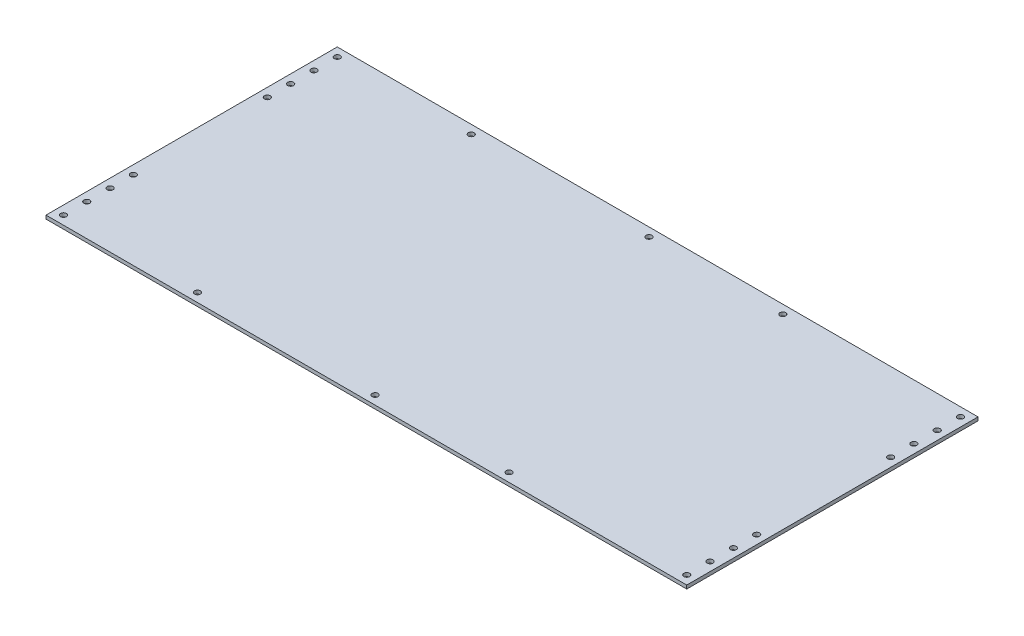
ISO-10303-21;
HEADER;
FILE_DESCRIPTION(('STEP AP214'),'2;1');
FILE_NAME('part.step','',(''),(''),'','','');
FILE_SCHEMA(('AUTOMOTIVE_DESIGN { 1 0 10303 214 1 1 1 1 }'));
ENDSEC;
DATA;
#1=APPLICATION_CONTEXT('core data for automotive mechanical design processes');
#2=APPLICATION_PROTOCOL_DEFINITION('international standard','automotive_design',2000,#1);
#3=PRODUCT_CONTEXT('',#1,'mechanical');
#4=PRODUCT('Part','Part','',(#3));
#5=PRODUCT_RELATED_PRODUCT_CATEGORY('part','',(#4));
#6=PRODUCT_DEFINITION_FORMATION('','',#4);
#7=PRODUCT_DEFINITION_CONTEXT('part definition',#1,'design');
#8=PRODUCT_DEFINITION('design','',#6,#7);
#9=PRODUCT_DEFINITION_SHAPE('','',#8);
#10=(LENGTH_UNIT() NAMED_UNIT(*) SI_UNIT(.MILLI.,.METRE.));
#11=(NAMED_UNIT(*) PLANE_ANGLE_UNIT() SI_UNIT($,.RADIAN.));
#12=(NAMED_UNIT(*) SI_UNIT($,.STERADIAN.) SOLID_ANGLE_UNIT());
#13=UNCERTAINTY_MEASURE_WITH_UNIT(LENGTH_MEASURE(1.E-05),#10,'distance_accuracy_value','');
#14=(GEOMETRIC_REPRESENTATION_CONTEXT(3) GLOBAL_UNCERTAINTY_ASSIGNED_CONTEXT((#13)) GLOBAL_UNIT_ASSIGNED_CONTEXT((#10,
#11,#12)) REPRESENTATION_CONTEXT('',''));
#15=CARTESIAN_POINT('',(0.,0.,0.));
#16=DIRECTION('',(0.,0.,1.));
#17=DIRECTION('',(1.,0.,0.));
#18=AXIS2_PLACEMENT_3D('',#15,#16,#17);
#19=CARTESIAN_POINT('',(-1100.,-12.,499.999999999999));
#20=DIRECTION('',(-1.,0.,0.));
#21=DIRECTION('',(0.,0.,1.));
#22=AXIS2_PLACEMENT_3D('',#19,#20,#21);
#23=PLANE('',#22);
#24=DIRECTION('',(0.,0.,1.));
#25=VECTOR('',#24,1.);
#26=CARTESIAN_POINT('',(-1100.,0.,499.999999999999));
#27=LINE('',#26,#25);
#28=CARTESIAN_POINT('',(-1100.,0.,-499.999999999999));
#29=VERTEX_POINT('',#28);
#30=CARTESIAN_POINT('',(-1100.,0.,499.999999999999));
#31=VERTEX_POINT('',#30);
#32=EDGE_CURVE('E102',#29,#31,#27,.T.);
#33=ORIENTED_EDGE('',*,*,#32,.F.);
#34=DIRECTION('',(0.,1.,0.));
#35=VECTOR('',#34,1.);
#36=CARTESIAN_POINT('',(-1100.,-12.,-499.999999999999));
#37=LINE('',#36,#35);
#38=CARTESIAN_POINT('',(-1100.,-12.,-499.999999999999));
#39=VERTEX_POINT('',#38);
#40=EDGE_CURVE('E11',#39,#29,#37,.T.);
#41=ORIENTED_EDGE('',*,*,#40,.F.);
#42=DIRECTION('',(0.,0.,1.));
#43=VECTOR('',#42,1.);
#44=CARTESIAN_POINT('',(-1100.,-12.,499.999999999999));
#45=LINE('',#44,#43);
#46=CARTESIAN_POINT('',(-1100.,-12.,499.999999999999));
#47=VERTEX_POINT('',#46);
#48=EDGE_CURVE('E100',#39,#47,#45,.T.);
#49=ORIENTED_EDGE('',*,*,#48,.T.);
#50=DIRECTION('',(0.,1.,0.));
#51=VECTOR('',#50,1.);
#52=CARTESIAN_POINT('',(-1100.,-12.,499.999999999999));
#53=LINE('',#52,#51);
#54=EDGE_CURVE('E45',#47,#31,#53,.T.);
#55=ORIENTED_EDGE('',*,*,#54,.T.);
#56=EDGE_LOOP('',(#33,#41,#49,#55));
#57=FACE_BOUND('',#56,.T.);
#58=ADVANCED_FACE('F39',(#57),#23,.T.);
#59=CARTESIAN_POINT('',(-1100.,-12.,-499.999999999999));
#60=DIRECTION('',(0.,0.,-1.));
#61=DIRECTION('',(-1.,0.,0.));
#62=AXIS2_PLACEMENT_3D('',#59,#60,#61);
#63=PLANE('',#62);
#64=DIRECTION('',(-1.,0.,0.));
#65=VECTOR('',#64,1.);
#66=CARTESIAN_POINT('',(-1100.,0.,-499.999999999999));
#67=LINE('',#66,#65);
#68=CARTESIAN_POINT('',(1100.,0.,-499.999999999999));
#69=VERTEX_POINT('',#68);
#70=EDGE_CURVE('E97',#69,#29,#67,.T.);
#71=ORIENTED_EDGE('',*,*,#70,.F.);
#72=DIRECTION('',(0.,1.,0.));
#73=VECTOR('',#72,1.);
#74=CARTESIAN_POINT('',(1100.,-12.,-499.999999999999));
#75=LINE('',#74,#73);
#76=CARTESIAN_POINT('',(1100.,-12.,-499.999999999999));
#77=VERTEX_POINT('',#76);
#78=EDGE_CURVE('E48',#77,#69,#75,.T.);
#79=ORIENTED_EDGE('',*,*,#78,.F.);
#80=DIRECTION('',(-1.,0.,0.));
#81=VECTOR('',#80,1.);
#82=CARTESIAN_POINT('',(-1100.,-12.,-499.999999999999));
#83=LINE('',#82,#81);
#84=EDGE_CURVE('E94',#77,#39,#83,.T.);
#85=ORIENTED_EDGE('',*,*,#84,.T.);
#86=ORIENTED_EDGE('',*,*,#40,.T.);
#87=EDGE_LOOP('',(#71,#79,#85,#86));
#88=FACE_BOUND('',#87,.T.);
#89=ADVANCED_FACE('F113',(#88),#63,.T.);
#90=CARTESIAN_POINT('',(1100.,-12.,500.000000000001));
#91=DIRECTION('',(1.,0.,0.));
#92=DIRECTION('',(0.,0.,-1.));
#93=AXIS2_PLACEMENT_3D('',#90,#91,#92);
#94=PLANE('',#93);
#95=DIRECTION('',(0.,0.,-1.));
#96=VECTOR('',#95,1.);
#97=CARTESIAN_POINT('',(1100.,0.,500.000000000001));
#98=LINE('',#97,#96);
#99=CARTESIAN_POINT('',(1100.,0.,500.000000000001));
#100=VERTEX_POINT('',#99);
#101=EDGE_CURVE('E90',#100,#69,#98,.T.);
#102=ORIENTED_EDGE('',*,*,#101,.F.);
#103=DIRECTION('',(0.,1.,0.));
#104=VECTOR('',#103,1.);
#105=CARTESIAN_POINT('',(1100.,-12.,500.000000000001));
#106=LINE('',#105,#104);
#107=CARTESIAN_POINT('',(1100.,-12.,500.000000000001));
#108=VERTEX_POINT('',#107);
#109=EDGE_CURVE('E82',#108,#100,#106,.T.);
#110=ORIENTED_EDGE('',*,*,#109,.F.);
#111=DIRECTION('',(0.,0.,-1.));
#112=VECTOR('',#111,1.);
#113=CARTESIAN_POINT('',(1100.,-12.,500.000000000001));
#114=LINE('',#113,#112);
#115=EDGE_CURVE('E87',#108,#77,#114,.T.);
#116=ORIENTED_EDGE('',*,*,#115,.T.);
#117=ORIENTED_EDGE('',*,*,#78,.T.);
#118=EDGE_LOOP('',(#102,#110,#116,#117));
#119=FACE_BOUND('',#118,.T.);
#120=ADVANCED_FACE('F88',(#119),#94,.T.);
#121=CARTESIAN_POINT('',(-1100.,-12.,499.999999999999));
#122=DIRECTION('',(0.,0.,1.));
#123=DIRECTION('',(1.,0.,0.));
#124=AXIS2_PLACEMENT_3D('',#121,#122,#123);
#125=PLANE('',#124);
#126=DIRECTION('',(1.,0.,0.));
#127=VECTOR('',#126,1.);
#128=CARTESIAN_POINT('',(-1100.,0.,499.999999999999));
#129=LINE('',#128,#127);
#130=EDGE_CURVE('E110',#31,#100,#129,.T.);
#131=ORIENTED_EDGE('',*,*,#130,.F.);
#132=ORIENTED_EDGE('',*,*,#54,.F.);
#133=DIRECTION('',(1.,0.,0.));
#134=VECTOR('',#133,1.);
#135=CARTESIAN_POINT('',(-1100.,-12.,499.999999999999));
#136=LINE('',#135,#134);
#137=EDGE_CURVE('E91',#47,#108,#136,.T.);
#138=ORIENTED_EDGE('',*,*,#137,.T.);
#139=ORIENTED_EDGE('',*,*,#109,.T.);
#140=EDGE_LOOP('',(#131,#132,#138,#139));
#141=FACE_BOUND('',#140,.T.);
#142=ADVANCED_FACE('F96',(#141),#125,.T.);
#143=CARTESIAN_POINT('',(0.,-12.,0.));
#144=DIRECTION('',(0.,-1.,0.));
#145=DIRECTION('',(0.,0.,-1.));
#146=AXIS2_PLACEMENT_3D('',#143,#144,#145);
#147=PLANE('',#146);
#148=CARTESIAN_POINT('',(-1070.,-12.,230.000000000003));
#149=DIRECTION('',(0.,1.,0.));
#150=DIRECTION('',(0.,0.,-1.));
#151=AXIS2_PLACEMENT_3D('',#148,#149,#150);
#152=CIRCLE('',#151,10.0000000000001);
#153=CARTESIAN_POINT('',(-1070.,-12.,220.000000000003));
#154=VERTEX_POINT('',#153);
#155=EDGE_CURVE('E229',#154,#154,#152,.T.);
#156=ORIENTED_EDGE('',*,*,#155,.T.);
#157=EDGE_LOOP('',(#156));
#158=FACE_BOUND('',#157,.T.);
#159=CARTESIAN_POINT('',(-1070.,-12.,310.000000000002));
#160=DIRECTION('',(0.,1.,0.));
#161=DIRECTION('',(0.,0.,-1.));
#162=AXIS2_PLACEMENT_3D('',#159,#160,#161);
#163=CIRCLE('',#162,9.99999999999988);
#164=CARTESIAN_POINT('',(-1070.,-12.,300.000000000002));
#165=VERTEX_POINT('',#164);
#166=EDGE_CURVE('E237',#165,#165,#163,.T.);
#167=ORIENTED_EDGE('',*,*,#166,.T.);
#168=EDGE_LOOP('',(#167));
#169=FACE_BOUND('',#168,.T.);
#170=CARTESIAN_POINT('',(-1070.,-12.,390.000000000001));
#171=DIRECTION('',(0.,1.,0.));
#172=DIRECTION('',(0.,0.,-1.));
#173=AXIS2_PLACEMENT_3D('',#170,#171,#172);
#174=CIRCLE('',#173,9.99999999999797);
#175=CARTESIAN_POINT('',(-1070.,-12.,380.000000000003));
#176=VERTEX_POINT('',#175);
#177=EDGE_CURVE('E245',#176,#176,#174,.T.);
#178=ORIENTED_EDGE('',*,*,#177,.T.);
#179=EDGE_LOOP('',(#178));
#180=FACE_BOUND('',#179,.T.);
#181=CARTESIAN_POINT('',(-1070.,-12.,470.));
#182=DIRECTION('',(0.,1.,0.));
#183=DIRECTION('',(0.,0.,-1.));
#184=AXIS2_PLACEMENT_3D('',#181,#182,#183);
#185=CIRCLE('',#184,10.0000000000001);
#186=CARTESIAN_POINT('',(-1070.,-12.,460.));
#187=VERTEX_POINT('',#186);
#188=EDGE_CURVE('E248',#187,#187,#185,.T.);
#189=ORIENTED_EDGE('',*,*,#188,.T.);
#190=EDGE_LOOP('',(#189));
#191=FACE_BOUND('',#190,.T.);
#192=CARTESIAN_POINT('',(-609.999999999998,-12.,469.999999999999));
#193=DIRECTION('',(0.,1.,0.));
#194=DIRECTION('',(0.,0.,-1.));
#195=AXIS2_PLACEMENT_3D('',#192,#193,#194);
#196=CIRCLE('',#195,9.99999999999998);
#197=CARTESIAN_POINT('',(-609.999999999998,-12.,459.999999999999));
#198=VERTEX_POINT('',#197);
#199=EDGE_CURVE('E255',#198,#198,#196,.T.);
#200=ORIENTED_EDGE('',*,*,#199,.T.);
#201=EDGE_LOOP('',(#200));
#202=FACE_BOUND('',#201,.T.);
#203=CARTESIAN_POINT('',(1.99840144432528E-12,-12.,469.999999999999));
#204=DIRECTION('',(0.,1.,0.));
#205=DIRECTION('',(0.,0.,-1.));
#206=AXIS2_PLACEMENT_3D('',#203,#204,#205);
#207=CIRCLE('',#206,9.99999999999998);
#208=CARTESIAN_POINT('',(1.99840144432528E-12,-12.,459.999999999999));
#209=VERTEX_POINT('',#208);
#210=EDGE_CURVE('E257',#209,#209,#207,.T.);
#211=ORIENTED_EDGE('',*,*,#210,.T.);
#212=EDGE_LOOP('',(#211));
#213=FACE_BOUND('',#212,.T.);
#214=CARTESIAN_POINT('',(460.000000000002,-12.,469.999999999999));
#215=DIRECTION('',(0.,1.,0.));
#216=DIRECTION('',(0.,0.,-1.));
#217=AXIS2_PLACEMENT_3D('',#214,#215,#216);
#218=CIRCLE('',#217,10.0000000000001);
#219=CARTESIAN_POINT('',(460.000000000002,-12.,459.999999999999));
#220=VERTEX_POINT('',#219);
#221=EDGE_CURVE('E266',#220,#220,#218,.T.);
#222=ORIENTED_EDGE('',*,*,#221,.T.);
#223=EDGE_LOOP('',(#222));
#224=FACE_BOUND('',#223,.T.);
#225=CARTESIAN_POINT('',(1070.,-12.,469.999999999999));
#226=DIRECTION('',(0.,1.,0.));
#227=DIRECTION('',(0.,0.,-1.));
#228=AXIS2_PLACEMENT_3D('',#225,#226,#227);
#229=CIRCLE('',#228,10.0000000000001);
#230=CARTESIAN_POINT('',(1070.,-12.,459.999999999999));
#231=VERTEX_POINT('',#230);
#232=EDGE_CURVE('E275',#231,#231,#229,.T.);
#233=ORIENTED_EDGE('',*,*,#232,.T.);
#234=EDGE_LOOP('',(#233));
#235=FACE_BOUND('',#234,.T.);
#236=CARTESIAN_POINT('',(1070.,-12.,390.));
#237=DIRECTION('',(0.,1.,0.));
#238=DIRECTION('',(0.,0.,-1.));
#239=AXIS2_PLACEMENT_3D('',#236,#237,#238);
#240=CIRCLE('',#239,9.99999999999818);
#241=CARTESIAN_POINT('',(1070.,-12.,380.000000000002));
#242=VERTEX_POINT('',#241);
#243=EDGE_CURVE('E279',#242,#242,#240,.T.);
#244=ORIENTED_EDGE('',*,*,#243,.T.);
#245=EDGE_LOOP('',(#244));
#246=FACE_BOUND('',#245,.T.);
#247=CARTESIAN_POINT('',(1070.,-12.,310.000000000001));
#248=DIRECTION('',(0.,1.,0.));
#249=DIRECTION('',(0.,0.,-1.));
#250=AXIS2_PLACEMENT_3D('',#247,#248,#249);
#251=CIRCLE('',#250,10.0000000000001);
#252=CARTESIAN_POINT('',(1070.,-12.,300.000000000001));
#253=VERTEX_POINT('',#252);
#254=EDGE_CURVE('E281',#253,#253,#251,.T.);
#255=ORIENTED_EDGE('',*,*,#254,.T.);
#256=EDGE_LOOP('',(#255));
#257=FACE_BOUND('',#256,.T.);
#258=CARTESIAN_POINT('',(1070.,-12.,230.000000000002));
#259=DIRECTION('',(0.,1.,0.));
#260=DIRECTION('',(0.,0.,-1.));
#261=AXIS2_PLACEMENT_3D('',#258,#259,#260);
#262=CIRCLE('',#261,10.0000000000001);
#263=CARTESIAN_POINT('',(1070.,-12.,220.000000000002));
#264=VERTEX_POINT('',#263);
#265=EDGE_CURVE('E288',#264,#264,#262,.T.);
#266=ORIENTED_EDGE('',*,*,#265,.T.);
#267=EDGE_LOOP('',(#266));
#268=FACE_BOUND('',#267,.T.);
#269=CARTESIAN_POINT('',(-1070.,-12.,-310.000000000001));
#270=DIRECTION('',(0.,1.,0.));
#271=DIRECTION('',(0.,0.,1.));
#272=AXIS2_PLACEMENT_3D('',#269,#270,#271);
#273=CIRCLE('',#272,9.99999999999988);
#274=CARTESIAN_POINT('',(-1070.,-12.,-300.000000000001));
#275=VERTEX_POINT('',#274);
#276=EDGE_CURVE('E297',#275,#275,#273,.T.);
#277=ORIENTED_EDGE('',*,*,#276,.T.);
#278=EDGE_LOOP('',(#277));
#279=FACE_BOUND('',#278,.T.);
#280=CARTESIAN_POINT('',(-1070.,-12.,-230.000000000002));
#281=DIRECTION('',(0.,1.,0.));
#282=DIRECTION('',(0.,0.,1.));
#283=AXIS2_PLACEMENT_3D('',#280,#281,#282);
#284=CIRCLE('',#283,10.0000000000001);
#285=CARTESIAN_POINT('',(-1070.,-12.,-220.000000000002));
#286=VERTEX_POINT('',#285);
#287=EDGE_CURVE('E305',#286,#286,#284,.T.);
#288=ORIENTED_EDGE('',*,*,#287,.T.);
#289=EDGE_LOOP('',(#288));
#290=FACE_BOUND('',#289,.T.);
#291=CARTESIAN_POINT('',(-1070.,-12.,-390.));
#292=DIRECTION('',(0.,1.,0.));
#293=DIRECTION('',(0.,0.,1.));
#294=AXIS2_PLACEMENT_3D('',#291,#292,#293);
#295=CIRCLE('',#294,9.99999999999797);
#296=CARTESIAN_POINT('',(-1070.,-12.,-380.000000000002));
#297=VERTEX_POINT('',#296);
#298=EDGE_CURVE('E306',#297,#297,#295,.T.);
#299=ORIENTED_EDGE('',*,*,#298,.T.);
#300=EDGE_LOOP('',(#299));
#301=FACE_BOUND('',#300,.T.);
#302=CARTESIAN_POINT('',(-609.999999999998,-12.,-469.999999999999));
#303=DIRECTION('',(0.,1.,0.));
#304=DIRECTION('',(0.,0.,1.));
#305=AXIS2_PLACEMENT_3D('',#302,#303,#304);
#306=CIRCLE('',#305,9.99999999999998);
#307=CARTESIAN_POINT('',(-609.999999999998,-12.,-459.999999999999));
#308=VERTEX_POINT('',#307);
#309=EDGE_CURVE('E314',#308,#308,#306,.T.);
#310=ORIENTED_EDGE('',*,*,#309,.T.);
#311=EDGE_LOOP('',(#310));
#312=FACE_BOUND('',#311,.T.);
#313=CARTESIAN_POINT('',(1.99840144432528E-12,-12.,-469.999999999999));
#314=DIRECTION('',(0.,1.,0.));
#315=DIRECTION('',(0.,0.,1.));
#316=AXIS2_PLACEMENT_3D('',#313,#314,#315);
#317=CIRCLE('',#316,9.99999999999998);
#318=CARTESIAN_POINT('',(1.99840144432528E-12,-12.,-459.999999999999));
#319=VERTEX_POINT('',#318);
#320=EDGE_CURVE('E319',#319,#319,#317,.T.);
#321=ORIENTED_EDGE('',*,*,#320,.T.);
#322=EDGE_LOOP('',(#321));
#323=FACE_BOUND('',#322,.T.);
#324=CARTESIAN_POINT('',(460.000000000002,-12.,-469.999999999999));
#325=DIRECTION('',(0.,1.,0.));
#326=DIRECTION('',(0.,0.,1.));
#327=AXIS2_PLACEMENT_3D('',#324,#325,#326);
#328=CIRCLE('',#327,10.0000000000001);
#329=CARTESIAN_POINT('',(460.000000000002,-12.,-459.999999999999));
#330=VERTEX_POINT('',#329);
#331=EDGE_CURVE('E326',#330,#330,#328,.T.);
#332=ORIENTED_EDGE('',*,*,#331,.T.);
#333=EDGE_LOOP('',(#332));
#334=FACE_BOUND('',#333,.T.);
#335=CARTESIAN_POINT('',(1070.,-12.,-390.));
#336=DIRECTION('',(0.,1.,0.));
#337=DIRECTION('',(0.,0.,1.));
#338=AXIS2_PLACEMENT_3D('',#335,#336,#337);
#339=CIRCLE('',#338,9.99999999999818);
#340=CARTESIAN_POINT('',(1070.,-12.,-380.000000000002));
#341=VERTEX_POINT('',#340);
#342=EDGE_CURVE('E335',#341,#341,#339,.T.);
#343=ORIENTED_EDGE('',*,*,#342,.T.);
#344=EDGE_LOOP('',(#343));
#345=FACE_BOUND('',#344,.T.);
#346=CARTESIAN_POINT('',(1070.,-12.,-310.000000000001));
#347=DIRECTION('',(0.,1.,0.));
#348=DIRECTION('',(0.,0.,1.));
#349=AXIS2_PLACEMENT_3D('',#346,#347,#348);
#350=CIRCLE('',#349,10.0000000000001);
#351=CARTESIAN_POINT('',(1070.,-12.,-300.000000000001));
#352=VERTEX_POINT('',#351);
#353=EDGE_CURVE('E339',#352,#352,#350,.T.);
#354=ORIENTED_EDGE('',*,*,#353,.T.);
#355=EDGE_LOOP('',(#354));
#356=FACE_BOUND('',#355,.T.);
#357=CARTESIAN_POINT('',(1070.,-12.,-230.000000000002));
#358=DIRECTION('',(0.,1.,0.));
#359=DIRECTION('',(0.,0.,1.));
#360=AXIS2_PLACEMENT_3D('',#357,#358,#359);
#361=CIRCLE('',#360,10.0000000000001);
#362=CARTESIAN_POINT('',(1070.,-12.,-220.000000000002));
#363=VERTEX_POINT('',#362);
#364=EDGE_CURVE('E341',#363,#363,#361,.T.);
#365=ORIENTED_EDGE('',*,*,#364,.T.);
#366=EDGE_LOOP('',(#365));
#367=FACE_BOUND('',#366,.T.);
#368=CARTESIAN_POINT('',(1070.,-12.,-469.999999999999));
#369=DIRECTION('',(0.,1.,0.));
#370=DIRECTION('',(0.,0.,1.));
#371=AXIS2_PLACEMENT_3D('',#368,#369,#370);
#372=CIRCLE('',#371,10.0000000000001);
#373=CARTESIAN_POINT('',(1070.,-12.,-459.999999999999));
#374=VERTEX_POINT('',#373);
#375=EDGE_CURVE('E348',#374,#374,#372,.T.);
#376=ORIENTED_EDGE('',*,*,#375,.T.);
#377=EDGE_LOOP('',(#376));
#378=FACE_BOUND('',#377,.T.);
#379=CARTESIAN_POINT('',(-1070.,-12.,-469.999999999999));
#380=DIRECTION('',(0.,1.,0.));
#381=DIRECTION('',(0.,0.,1.));
#382=AXIS2_PLACEMENT_3D('',#379,#380,#381);
#383=CIRCLE('',#382,9.99999999999988);
#384=CARTESIAN_POINT('',(-1070.,-12.,-459.999999999999));
#385=VERTEX_POINT('',#384);
#386=EDGE_CURVE('E107',#385,#385,#383,.T.);
#387=ORIENTED_EDGE('',*,*,#386,.T.);
#388=EDGE_LOOP('',(#387));
#389=FACE_BOUND('',#388,.T.);
#390=ORIENTED_EDGE('',*,*,#48,.F.);
#391=ORIENTED_EDGE('',*,*,#84,.F.);
#392=ORIENTED_EDGE('',*,*,#115,.F.);
#393=ORIENTED_EDGE('',*,*,#137,.F.);
#394=EDGE_LOOP('',(#390,#391,#392,#393));
#395=FACE_BOUND('',#394,.T.);
#396=ADVANCED_FACE('F95',(#158,#169,#180,#191,#202,#213,#224,#235,#246,#257,#268,#279,#290,#301,
#312,#323,#334,#345,#356,#367,#378,#389,#395),#147,.T.);
#397=CARTESIAN_POINT('',(0.,0.,0.));
#398=DIRECTION('',(0.,-1.,0.));
#399=DIRECTION('',(0.,0.,-1.));
#400=AXIS2_PLACEMENT_3D('',#397,#398,#399);
#401=PLANE('',#400);
#402=CARTESIAN_POINT('',(-1070.,0.,230.000000000003));
#403=DIRECTION('',(0.,1.,0.));
#404=DIRECTION('',(0.,0.,-1.));
#405=AXIS2_PLACEMENT_3D('',#402,#403,#404);
#406=CIRCLE('',#405,10.0000000000001);
#407=CARTESIAN_POINT('',(-1070.,0.,220.000000000003));
#408=VERTEX_POINT('',#407);
#409=EDGE_CURVE('E232',#408,#408,#406,.T.);
#410=ORIENTED_EDGE('',*,*,#409,.F.);
#411=EDGE_LOOP('',(#410));
#412=FACE_BOUND('',#411,.T.);
#413=CARTESIAN_POINT('',(-1070.,0.,310.000000000002));
#414=DIRECTION('',(0.,1.,0.));
#415=DIRECTION('',(0.,0.,-1.));
#416=AXIS2_PLACEMENT_3D('',#413,#414,#415);
#417=CIRCLE('',#416,9.99999999999988);
#418=CARTESIAN_POINT('',(-1070.,0.,300.000000000002));
#419=VERTEX_POINT('',#418);
#420=EDGE_CURVE('E234',#419,#419,#417,.T.);
#421=ORIENTED_EDGE('',*,*,#420,.F.);
#422=EDGE_LOOP('',(#421));
#423=FACE_BOUND('',#422,.T.);
#424=CARTESIAN_POINT('',(-1070.,0.,390.000000000001));
#425=DIRECTION('',(0.,1.,0.));
#426=DIRECTION('',(0.,0.,-1.));
#427=AXIS2_PLACEMENT_3D('',#424,#425,#426);
#428=CIRCLE('',#427,9.99999999999797);
#429=CARTESIAN_POINT('',(-1070.,0.,380.000000000003));
#430=VERTEX_POINT('',#429);
#431=EDGE_CURVE('E239',#430,#430,#428,.T.);
#432=ORIENTED_EDGE('',*,*,#431,.F.);
#433=EDGE_LOOP('',(#432));
#434=FACE_BOUND('',#433,.T.);
#435=CARTESIAN_POINT('',(-1070.,0.,470.));
#436=DIRECTION('',(0.,1.,0.));
#437=DIRECTION('',(0.,0.,-1.));
#438=AXIS2_PLACEMENT_3D('',#435,#436,#437);
#439=CIRCLE('',#438,10.0000000000001);
#440=CARTESIAN_POINT('',(-1070.,0.,460.));
#441=VERTEX_POINT('',#440);
#442=EDGE_CURVE('E243',#441,#441,#439,.T.);
#443=ORIENTED_EDGE('',*,*,#442,.F.);
#444=EDGE_LOOP('',(#443));
#445=FACE_BOUND('',#444,.T.);
#446=CARTESIAN_POINT('',(-609.999999999998,0.,469.999999999999));
#447=DIRECTION('',(0.,1.,0.));
#448=DIRECTION('',(0.,0.,-1.));
#449=AXIS2_PLACEMENT_3D('',#446,#447,#448);
#450=CIRCLE('',#449,9.99999999999998);
#451=CARTESIAN_POINT('',(-609.999999999998,0.,459.999999999999));
#452=VERTEX_POINT('',#451);
#453=EDGE_CURVE('E253',#452,#452,#450,.T.);
#454=ORIENTED_EDGE('',*,*,#453,.F.);
#455=EDGE_LOOP('',(#454));
#456=FACE_BOUND('',#455,.T.);
#457=CARTESIAN_POINT('',(1.99840144432528E-12,0.,469.999999999999));
#458=DIRECTION('',(0.,1.,0.));
#459=DIRECTION('',(0.,0.,-1.));
#460=AXIS2_PLACEMENT_3D('',#457,#458,#459);
#461=CIRCLE('',#460,9.99999999999998);
#462=CARTESIAN_POINT('',(1.99840144432528E-12,0.,459.999999999999));
#463=VERTEX_POINT('',#462);
#464=EDGE_CURVE('E260',#463,#463,#461,.T.);
#465=ORIENTED_EDGE('',*,*,#464,.F.);
#466=EDGE_LOOP('',(#465));
#467=FACE_BOUND('',#466,.T.);
#468=CARTESIAN_POINT('',(460.000000000002,0.,469.999999999999));
#469=DIRECTION('',(0.,1.,0.));
#470=DIRECTION('',(0.,0.,-1.));
#471=AXIS2_PLACEMENT_3D('',#468,#469,#470);
#472=CIRCLE('',#471,10.0000000000001);
#473=CARTESIAN_POINT('',(460.000000000002,0.,459.999999999999));
#474=VERTEX_POINT('',#473);
#475=EDGE_CURVE('E263',#474,#474,#472,.T.);
#476=ORIENTED_EDGE('',*,*,#475,.F.);
#477=EDGE_LOOP('',(#476));
#478=FACE_BOUND('',#477,.T.);
#479=CARTESIAN_POINT('',(1070.,0.,469.999999999999));
#480=DIRECTION('',(0.,1.,0.));
#481=DIRECTION('',(0.,0.,-1.));
#482=AXIS2_PLACEMENT_3D('',#479,#480,#481);
#483=CIRCLE('',#482,10.0000000000001);
#484=CARTESIAN_POINT('',(1070.,0.,459.999999999999));
#485=VERTEX_POINT('',#484);
#486=EDGE_CURVE('E267',#485,#485,#483,.T.);
#487=ORIENTED_EDGE('',*,*,#486,.F.);
#488=EDGE_LOOP('',(#487));
#489=FACE_BOUND('',#488,.T.);
#490=CARTESIAN_POINT('',(1070.,0.,390.));
#491=DIRECTION('',(0.,1.,0.));
#492=DIRECTION('',(0.,0.,-1.));
#493=AXIS2_PLACEMENT_3D('',#490,#491,#492);
#494=CIRCLE('',#493,9.99999999999818);
#495=CARTESIAN_POINT('',(1070.,0.,380.000000000002));
#496=VERTEX_POINT('',#495);
#497=EDGE_CURVE('E274',#496,#496,#494,.T.);
#498=ORIENTED_EDGE('',*,*,#497,.F.);
#499=EDGE_LOOP('',(#498));
#500=FACE_BOUND('',#499,.T.);
#501=CARTESIAN_POINT('',(1070.,0.,310.000000000001));
#502=DIRECTION('',(0.,1.,0.));
#503=DIRECTION('',(0.,0.,-1.));
#504=AXIS2_PLACEMENT_3D('',#501,#502,#503);
#505=CIRCLE('',#504,10.0000000000001);
#506=CARTESIAN_POINT('',(1070.,0.,300.000000000001));
#507=VERTEX_POINT('',#506);
#508=EDGE_CURVE('E282',#507,#507,#505,.T.);
#509=ORIENTED_EDGE('',*,*,#508,.F.);
#510=EDGE_LOOP('',(#509));
#511=FACE_BOUND('',#510,.T.);
#512=CARTESIAN_POINT('',(1070.,0.,230.000000000002));
#513=DIRECTION('',(0.,1.,0.));
#514=DIRECTION('',(0.,0.,-1.));
#515=AXIS2_PLACEMENT_3D('',#512,#513,#514);
#516=CIRCLE('',#515,10.0000000000001);
#517=CARTESIAN_POINT('',(1070.,0.,220.000000000002));
#518=VERTEX_POINT('',#517);
#519=EDGE_CURVE('E290',#518,#518,#516,.T.);
#520=ORIENTED_EDGE('',*,*,#519,.F.);
#521=EDGE_LOOP('',(#520));
#522=FACE_BOUND('',#521,.T.);
#523=CARTESIAN_POINT('',(-1070.,0.,-310.000000000001));
#524=DIRECTION('',(0.,1.,0.));
#525=DIRECTION('',(0.,0.,1.));
#526=AXIS2_PLACEMENT_3D('',#523,#524,#525);
#527=CIRCLE('',#526,9.99999999999988);
#528=CARTESIAN_POINT('',(-1070.,0.,-300.000000000001));
#529=VERTEX_POINT('',#528);
#530=EDGE_CURVE('E291',#529,#529,#527,.T.);
#531=ORIENTED_EDGE('',*,*,#530,.F.);
#532=EDGE_LOOP('',(#531));
#533=FACE_BOUND('',#532,.T.);
#534=CARTESIAN_POINT('',(-1070.,0.,-230.000000000002));
#535=DIRECTION('',(0.,1.,0.));
#536=DIRECTION('',(0.,0.,1.));
#537=AXIS2_PLACEMENT_3D('',#534,#535,#536);
#538=CIRCLE('',#537,10.0000000000001);
#539=CARTESIAN_POINT('',(-1070.,0.,-220.000000000002));
#540=VERTEX_POINT('',#539);
#541=EDGE_CURVE('E296',#540,#540,#538,.T.);
#542=ORIENTED_EDGE('',*,*,#541,.F.);
#543=EDGE_LOOP('',(#542));
#544=FACE_BOUND('',#543,.T.);
#545=CARTESIAN_POINT('',(-1070.,0.,-390.));
#546=DIRECTION('',(0.,1.,0.));
#547=DIRECTION('',(0.,0.,1.));
#548=AXIS2_PLACEMENT_3D('',#545,#546,#547);
#549=CIRCLE('',#548,9.99999999999797);
#550=CARTESIAN_POINT('',(-1070.,0.,-380.000000000002));
#551=VERTEX_POINT('',#550);
#552=EDGE_CURVE('E304',#551,#551,#549,.T.);
#553=ORIENTED_EDGE('',*,*,#552,.F.);
#554=EDGE_LOOP('',(#553));
#555=FACE_BOUND('',#554,.T.);
#556=CARTESIAN_POINT('',(-609.999999999998,0.,-469.999999999999));
#557=DIRECTION('',(0.,1.,0.));
#558=DIRECTION('',(0.,0.,1.));
#559=AXIS2_PLACEMENT_3D('',#556,#557,#558);
#560=CIRCLE('',#559,9.99999999999998);
#561=CARTESIAN_POINT('',(-609.999999999998,0.,-459.999999999999));
#562=VERTEX_POINT('',#561);
#563=EDGE_CURVE('E313',#562,#562,#560,.T.);
#564=ORIENTED_EDGE('',*,*,#563,.F.);
#565=EDGE_LOOP('',(#564));
#566=FACE_BOUND('',#565,.T.);
#567=CARTESIAN_POINT('',(1.99840144432528E-12,0.,-469.999999999999));
#568=DIRECTION('',(0.,1.,0.));
#569=DIRECTION('',(0.,0.,1.));
#570=AXIS2_PLACEMENT_3D('',#567,#568,#569);
#571=CIRCLE('',#570,9.99999999999998);
#572=CARTESIAN_POINT('',(1.99840144432528E-12,0.,-459.999999999999));
#573=VERTEX_POINT('',#572);
#574=EDGE_CURVE('E320',#573,#573,#571,.T.);
#575=ORIENTED_EDGE('',*,*,#574,.F.);
#576=EDGE_LOOP('',(#575));
#577=FACE_BOUND('',#576,.T.);
#578=CARTESIAN_POINT('',(460.000000000002,0.,-469.999999999999));
#579=DIRECTION('',(0.,1.,0.));
#580=DIRECTION('',(0.,0.,1.));
#581=AXIS2_PLACEMENT_3D('',#578,#579,#580);
#582=CIRCLE('',#581,10.0000000000001);
#583=CARTESIAN_POINT('',(460.000000000002,0.,-459.999999999999));
#584=VERTEX_POINT('',#583);
#585=EDGE_CURVE('E323',#584,#584,#582,.T.);
#586=ORIENTED_EDGE('',*,*,#585,.F.);
#587=EDGE_LOOP('',(#586));
#588=FACE_BOUND('',#587,.T.);
#589=CARTESIAN_POINT('',(1070.,0.,-390.));
#590=DIRECTION('',(0.,1.,0.));
#591=DIRECTION('',(0.,0.,1.));
#592=AXIS2_PLACEMENT_3D('',#589,#590,#591);
#593=CIRCLE('',#592,9.99999999999818);
#594=CARTESIAN_POINT('',(1070.,0.,-380.000000000002));
#595=VERTEX_POINT('',#594);
#596=EDGE_CURVE('E328',#595,#595,#593,.T.);
#597=ORIENTED_EDGE('',*,*,#596,.F.);
#598=EDGE_LOOP('',(#597));
#599=FACE_BOUND('',#598,.T.);
#600=CARTESIAN_POINT('',(1070.,0.,-310.000000000001));
#601=DIRECTION('',(0.,1.,0.));
#602=DIRECTION('',(0.,0.,1.));
#603=AXIS2_PLACEMENT_3D('',#600,#601,#602);
#604=CIRCLE('',#603,10.0000000000001);
#605=CARTESIAN_POINT('',(1070.,0.,-300.000000000001));
#606=VERTEX_POINT('',#605);
#607=EDGE_CURVE('E333',#606,#606,#604,.T.);
#608=ORIENTED_EDGE('',*,*,#607,.F.);
#609=EDGE_LOOP('',(#608));
#610=FACE_BOUND('',#609,.T.);
#611=CARTESIAN_POINT('',(1070.,0.,-230.000000000002));
#612=DIRECTION('',(0.,1.,0.));
#613=DIRECTION('',(0.,0.,1.));
#614=AXIS2_PLACEMENT_3D('',#611,#612,#613);
#615=CIRCLE('',#614,10.0000000000001);
#616=CARTESIAN_POINT('',(1070.,0.,-220.000000000002));
#617=VERTEX_POINT('',#616);
#618=EDGE_CURVE('E342',#617,#617,#615,.T.);
#619=ORIENTED_EDGE('',*,*,#618,.F.);
#620=EDGE_LOOP('',(#619));
#621=FACE_BOUND('',#620,.T.);
#622=CARTESIAN_POINT('',(1070.,0.,-469.999999999999));
#623=DIRECTION('',(0.,1.,0.));
#624=DIRECTION('',(0.,0.,1.));
#625=AXIS2_PLACEMENT_3D('',#622,#623,#624);
#626=CIRCLE('',#625,10.0000000000001);
#627=CARTESIAN_POINT('',(1070.,0.,-459.999999999999));
#628=VERTEX_POINT('',#627);
#629=EDGE_CURVE('E350',#628,#628,#626,.T.);
#630=ORIENTED_EDGE('',*,*,#629,.F.);
#631=EDGE_LOOP('',(#630));
#632=FACE_BOUND('',#631,.T.);
#633=CARTESIAN_POINT('',(-1070.,0.,-469.999999999999));
#634=DIRECTION('',(0.,1.,0.));
#635=DIRECTION('',(0.,0.,1.));
#636=AXIS2_PLACEMENT_3D('',#633,#634,#635);
#637=CIRCLE('',#636,9.99999999999988);
#638=CARTESIAN_POINT('',(-1070.,0.,-459.999999999999));
#639=VERTEX_POINT('',#638);
#640=EDGE_CURVE('E354',#639,#639,#637,.T.);
#641=ORIENTED_EDGE('',*,*,#640,.F.);
#642=EDGE_LOOP('',(#641));
#643=FACE_BOUND('',#642,.T.);
#644=ORIENTED_EDGE('',*,*,#32,.T.);
#645=ORIENTED_EDGE('',*,*,#130,.T.);
#646=ORIENTED_EDGE('',*,*,#101,.T.);
#647=ORIENTED_EDGE('',*,*,#70,.T.);
#648=EDGE_LOOP('',(#644,#645,#646,#647));
#649=FACE_BOUND('',#648,.T.);
#650=ADVANCED_FACE('F111',(#412,#423,#434,#445,#456,#467,#478,#489,#500,#511,#522,#533,#544,
#555,#566,#577,#588,#599,#610,#621,#632,#643,#649),#401,.F.);
#651=CARTESIAN_POINT('',(-1070.,-12.,-469.999999999999));
#652=DIRECTION('',(0.,1.,0.));
#653=DIRECTION('',(0.,0.,1.));
#654=AXIS2_PLACEMENT_3D('',#651,#652,#653);
#655=CYLINDRICAL_SURFACE('',#654,9.99999999999988);
#656=ORIENTED_EDGE('',*,*,#386,.F.);
#657=EDGE_LOOP('',(#656));
#658=FACE_BOUND('',#657,.T.);
#659=ORIENTED_EDGE('',*,*,#640,.T.);
#660=EDGE_LOOP('',(#659));
#661=FACE_BOUND('',#660,.T.);
#662=ADVANCED_FACE('F134',(#658,#661),#655,.F.);
#663=CARTESIAN_POINT('',(1070.,-12.,-469.999999999999));
#664=DIRECTION('',(0.,1.,0.));
#665=DIRECTION('',(0.,0.,1.));
#666=AXIS2_PLACEMENT_3D('',#663,#664,#665);
#667=CYLINDRICAL_SURFACE('',#666,10.0000000000001);
#668=ORIENTED_EDGE('',*,*,#375,.F.);
#669=EDGE_LOOP('',(#668));
#670=FACE_BOUND('',#669,.T.);
#671=ORIENTED_EDGE('',*,*,#629,.T.);
#672=EDGE_LOOP('',(#671));
#673=FACE_BOUND('',#672,.T.);
#674=ADVANCED_FACE('F139',(#670,#673),#667,.F.);
#675=CARTESIAN_POINT('',(1070.,-12.,-230.000000000002));
#676=DIRECTION('',(0.,1.,0.));
#677=DIRECTION('',(0.,0.,1.));
#678=AXIS2_PLACEMENT_3D('',#675,#676,#677);
#679=CYLINDRICAL_SURFACE('',#678,10.0000000000001);
#680=ORIENTED_EDGE('',*,*,#364,.F.);
#681=EDGE_LOOP('',(#680));
#682=FACE_BOUND('',#681,.T.);
#683=ORIENTED_EDGE('',*,*,#618,.T.);
#684=EDGE_LOOP('',(#683));
#685=FACE_BOUND('',#684,.T.);
#686=ADVANCED_FACE('F145',(#682,#685),#679,.F.);
#687=CARTESIAN_POINT('',(1070.,-12.,-310.000000000001));
#688=DIRECTION('',(0.,1.,0.));
#689=DIRECTION('',(0.,0.,1.));
#690=AXIS2_PLACEMENT_3D('',#687,#688,#689);
#691=CYLINDRICAL_SURFACE('',#690,10.0000000000001);
#692=ORIENTED_EDGE('',*,*,#353,.F.);
#693=EDGE_LOOP('',(#692));
#694=FACE_BOUND('',#693,.T.);
#695=ORIENTED_EDGE('',*,*,#607,.T.);
#696=EDGE_LOOP('',(#695));
#697=FACE_BOUND('',#696,.T.);
#698=ADVANCED_FACE('F146',(#694,#697),#691,.F.);
#699=CARTESIAN_POINT('',(1070.,-12.,-390.));
#700=DIRECTION('',(0.,1.,0.));
#701=DIRECTION('',(0.,0.,1.));
#702=AXIS2_PLACEMENT_3D('',#699,#700,#701);
#703=CYLINDRICAL_SURFACE('',#702,9.99999999999818);
#704=ORIENTED_EDGE('',*,*,#342,.F.);
#705=EDGE_LOOP('',(#704));
#706=FACE_BOUND('',#705,.T.);
#707=ORIENTED_EDGE('',*,*,#596,.T.);
#708=EDGE_LOOP('',(#707));
#709=FACE_BOUND('',#708,.T.);
#710=ADVANCED_FACE('F155',(#706,#709),#703,.F.);
#711=CARTESIAN_POINT('',(460.000000000002,-12.,-469.999999999999));
#712=DIRECTION('',(0.,1.,0.));
#713=DIRECTION('',(0.,0.,1.));
#714=AXIS2_PLACEMENT_3D('',#711,#712,#713);
#715=CYLINDRICAL_SURFACE('',#714,10.0000000000001);
#716=ORIENTED_EDGE('',*,*,#331,.F.);
#717=EDGE_LOOP('',(#716));
#718=FACE_BOUND('',#717,.T.);
#719=ORIENTED_EDGE('',*,*,#585,.T.);
#720=EDGE_LOOP('',(#719));
#721=FACE_BOUND('',#720,.T.);
#722=ADVANCED_FACE('F156',(#718,#721),#715,.F.);
#723=CARTESIAN_POINT('',(1.99840144432528E-12,-12.,-469.999999999999));
#724=DIRECTION('',(0.,1.,0.));
#725=DIRECTION('',(0.,0.,1.));
#726=AXIS2_PLACEMENT_3D('',#723,#724,#725);
#727=CYLINDRICAL_SURFACE('',#726,9.99999999999998);
#728=ORIENTED_EDGE('',*,*,#320,.F.);
#729=EDGE_LOOP('',(#728));
#730=FACE_BOUND('',#729,.T.);
#731=ORIENTED_EDGE('',*,*,#574,.T.);
#732=EDGE_LOOP('',(#731));
#733=FACE_BOUND('',#732,.T.);
#734=ADVANCED_FACE('F159',(#730,#733),#727,.F.);
#735=CARTESIAN_POINT('',(-609.999999999998,-12.,-469.999999999999));
#736=DIRECTION('',(0.,1.,0.));
#737=DIRECTION('',(0.,0.,1.));
#738=AXIS2_PLACEMENT_3D('',#735,#736,#737);
#739=CYLINDRICAL_SURFACE('',#738,9.99999999999998);
#740=ORIENTED_EDGE('',*,*,#309,.F.);
#741=EDGE_LOOP('',(#740));
#742=FACE_BOUND('',#741,.T.);
#743=ORIENTED_EDGE('',*,*,#563,.T.);
#744=EDGE_LOOP('',(#743));
#745=FACE_BOUND('',#744,.T.);
#746=ADVANCED_FACE('F163',(#742,#745),#739,.F.);
#747=CARTESIAN_POINT('',(-1070.,-12.,-390.));
#748=DIRECTION('',(0.,1.,0.));
#749=DIRECTION('',(0.,0.,1.));
#750=AXIS2_PLACEMENT_3D('',#747,#748,#749);
#751=CYLINDRICAL_SURFACE('',#750,9.99999999999797);
#752=ORIENTED_EDGE('',*,*,#298,.F.);
#753=EDGE_LOOP('',(#752));
#754=FACE_BOUND('',#753,.T.);
#755=ORIENTED_EDGE('',*,*,#552,.T.);
#756=EDGE_LOOP('',(#755));
#757=FACE_BOUND('',#756,.T.);
#758=ADVANCED_FACE('F169',(#754,#757),#751,.F.);
#759=CARTESIAN_POINT('',(-1070.,-12.,-230.000000000002));
#760=DIRECTION('',(0.,1.,0.));
#761=DIRECTION('',(0.,0.,1.));
#762=AXIS2_PLACEMENT_3D('',#759,#760,#761);
#763=CYLINDRICAL_SURFACE('',#762,10.0000000000001);
#764=ORIENTED_EDGE('',*,*,#287,.F.);
#765=EDGE_LOOP('',(#764));
#766=FACE_BOUND('',#765,.T.);
#767=ORIENTED_EDGE('',*,*,#541,.T.);
#768=EDGE_LOOP('',(#767));
#769=FACE_BOUND('',#768,.T.);
#770=ADVANCED_FACE('F175',(#766,#769),#763,.F.);
#771=CARTESIAN_POINT('',(-1070.,-12.,-310.000000000001));
#772=DIRECTION('',(0.,1.,0.));
#773=DIRECTION('',(0.,0.,1.));
#774=AXIS2_PLACEMENT_3D('',#771,#772,#773);
#775=CYLINDRICAL_SURFACE('',#774,9.99999999999988);
#776=ORIENTED_EDGE('',*,*,#276,.F.);
#777=EDGE_LOOP('',(#776));
#778=FACE_BOUND('',#777,.T.);
#779=ORIENTED_EDGE('',*,*,#530,.T.);
#780=EDGE_LOOP('',(#779));
#781=FACE_BOUND('',#780,.T.);
#782=ADVANCED_FACE('F177',(#778,#781),#775,.F.);
#783=CARTESIAN_POINT('',(1070.,-12.,230.000000000002));
#784=DIRECTION('',(0.,1.,0.));
#785=DIRECTION('',(0.,0.,1.));
#786=AXIS2_PLACEMENT_3D('',#783,#784,#785);
#787=CYLINDRICAL_SURFACE('',#786,10.0000000000001);
#788=ORIENTED_EDGE('',*,*,#265,.F.);
#789=EDGE_LOOP('',(#788));
#790=FACE_BOUND('',#789,.T.);
#791=ORIENTED_EDGE('',*,*,#519,.T.);
#792=EDGE_LOOP('',(#791));
#793=FACE_BOUND('',#792,.T.);
#794=ADVANCED_FACE('F178',(#790,#793),#787,.F.);
#795=CARTESIAN_POINT('',(1070.,-12.,310.000000000001));
#796=DIRECTION('',(0.,1.,0.));
#797=DIRECTION('',(0.,0.,1.));
#798=AXIS2_PLACEMENT_3D('',#795,#796,#797);
#799=CYLINDRICAL_SURFACE('',#798,10.0000000000001);
#800=ORIENTED_EDGE('',*,*,#254,.F.);
#801=EDGE_LOOP('',(#800));
#802=FACE_BOUND('',#801,.T.);
#803=ORIENTED_EDGE('',*,*,#508,.T.);
#804=EDGE_LOOP('',(#803));
#805=FACE_BOUND('',#804,.T.);
#806=ADVANCED_FACE('F184',(#802,#805),#799,.F.);
#807=CARTESIAN_POINT('',(1070.,-12.,390.));
#808=DIRECTION('',(0.,1.,0.));
#809=DIRECTION('',(0.,0.,1.));
#810=AXIS2_PLACEMENT_3D('',#807,#808,#809);
#811=CYLINDRICAL_SURFACE('',#810,9.99999999999818);
#812=ORIENTED_EDGE('',*,*,#243,.F.);
#813=EDGE_LOOP('',(#812));
#814=FACE_BOUND('',#813,.T.);
#815=ORIENTED_EDGE('',*,*,#497,.T.);
#816=EDGE_LOOP('',(#815));
#817=FACE_BOUND('',#816,.T.);
#818=ADVANCED_FACE('F189',(#814,#817),#811,.F.);
#819=CARTESIAN_POINT('',(1070.,-12.,469.999999999999));
#820=DIRECTION('',(0.,1.,0.));
#821=DIRECTION('',(0.,0.,1.));
#822=AXIS2_PLACEMENT_3D('',#819,#820,#821);
#823=CYLINDRICAL_SURFACE('',#822,10.0000000000001);
#824=ORIENTED_EDGE('',*,*,#232,.F.);
#825=EDGE_LOOP('',(#824));
#826=FACE_BOUND('',#825,.T.);
#827=ORIENTED_EDGE('',*,*,#486,.T.);
#828=EDGE_LOOP('',(#827));
#829=FACE_BOUND('',#828,.T.);
#830=ADVANCED_FACE('F195',(#826,#829),#823,.F.);
#831=CARTESIAN_POINT('',(460.000000000002,-12.,469.999999999999));
#832=DIRECTION('',(0.,1.,0.));
#833=DIRECTION('',(0.,0.,1.));
#834=AXIS2_PLACEMENT_3D('',#831,#832,#833);
#835=CYLINDRICAL_SURFACE('',#834,10.0000000000001);
#836=ORIENTED_EDGE('',*,*,#221,.F.);
#837=EDGE_LOOP('',(#836));
#838=FACE_BOUND('',#837,.T.);
#839=ORIENTED_EDGE('',*,*,#475,.T.);
#840=EDGE_LOOP('',(#839));
#841=FACE_BOUND('',#840,.T.);
#842=ADVANCED_FACE('F198',(#838,#841),#835,.F.);
#843=CARTESIAN_POINT('',(1.99840144432528E-12,-12.,469.999999999999));
#844=DIRECTION('',(0.,1.,0.));
#845=DIRECTION('',(0.,0.,1.));
#846=AXIS2_PLACEMENT_3D('',#843,#844,#845);
#847=CYLINDRICAL_SURFACE('',#846,9.99999999999998);
#848=ORIENTED_EDGE('',*,*,#210,.F.);
#849=EDGE_LOOP('',(#848));
#850=FACE_BOUND('',#849,.T.);
#851=ORIENTED_EDGE('',*,*,#464,.T.);
#852=EDGE_LOOP('',(#851));
#853=FACE_BOUND('',#852,.T.);
#854=ADVANCED_FACE('F199',(#850,#853),#847,.F.);
#855=CARTESIAN_POINT('',(-609.999999999998,-12.,469.999999999999));
#856=DIRECTION('',(0.,1.,0.));
#857=DIRECTION('',(0.,0.,1.));
#858=AXIS2_PLACEMENT_3D('',#855,#856,#857);
#859=CYLINDRICAL_SURFACE('',#858,9.99999999999998);
#860=ORIENTED_EDGE('',*,*,#199,.F.);
#861=EDGE_LOOP('',(#860));
#862=FACE_BOUND('',#861,.T.);
#863=ORIENTED_EDGE('',*,*,#453,.T.);
#864=EDGE_LOOP('',(#863));
#865=FACE_BOUND('',#864,.T.);
#866=ADVANCED_FACE('F204',(#862,#865),#859,.F.);
#867=CARTESIAN_POINT('',(-1070.,-12.,470.));
#868=DIRECTION('',(0.,1.,0.));
#869=DIRECTION('',(0.,0.,1.));
#870=AXIS2_PLACEMENT_3D('',#867,#868,#869);
#871=CYLINDRICAL_SURFACE('',#870,10.0000000000001);
#872=ORIENTED_EDGE('',*,*,#188,.F.);
#873=EDGE_LOOP('',(#872));
#874=FACE_BOUND('',#873,.T.);
#875=ORIENTED_EDGE('',*,*,#442,.T.);
#876=EDGE_LOOP('',(#875));
#877=FACE_BOUND('',#876,.T.);
#878=ADVANCED_FACE('F208',(#874,#877),#871,.F.);
#879=CARTESIAN_POINT('',(-1070.,-12.,390.000000000001));
#880=DIRECTION('',(0.,1.,0.));
#881=DIRECTION('',(0.,0.,1.));
#882=AXIS2_PLACEMENT_3D('',#879,#880,#881);
#883=CYLINDRICAL_SURFACE('',#882,9.99999999999797);
#884=ORIENTED_EDGE('',*,*,#177,.F.);
#885=EDGE_LOOP('',(#884));
#886=FACE_BOUND('',#885,.T.);
#887=ORIENTED_EDGE('',*,*,#431,.T.);
#888=EDGE_LOOP('',(#887));
#889=FACE_BOUND('',#888,.T.);
#890=ADVANCED_FACE('F215',(#886,#889),#883,.F.);
#891=CARTESIAN_POINT('',(-1070.,-12.,310.000000000002));
#892=DIRECTION('',(0.,1.,0.));
#893=DIRECTION('',(0.,0.,1.));
#894=AXIS2_PLACEMENT_3D('',#891,#892,#893);
#895=CYLINDRICAL_SURFACE('',#894,9.99999999999988);
#896=ORIENTED_EDGE('',*,*,#166,.F.);
#897=EDGE_LOOP('',(#896));
#898=FACE_BOUND('',#897,.T.);
#899=ORIENTED_EDGE('',*,*,#420,.T.);
#900=EDGE_LOOP('',(#899));
#901=FACE_BOUND('',#900,.T.);
#902=ADVANCED_FACE('F216',(#898,#901),#895,.F.);
#903=CARTESIAN_POINT('',(-1070.,-12.,230.000000000003));
#904=DIRECTION('',(0.,1.,0.));
#905=DIRECTION('',(0.,0.,1.));
#906=AXIS2_PLACEMENT_3D('',#903,#904,#905);
#907=CYLINDRICAL_SURFACE('',#906,10.0000000000001);
#908=ORIENTED_EDGE('',*,*,#155,.F.);
#909=EDGE_LOOP('',(#908));
#910=FACE_BOUND('',#909,.T.);
#911=ORIENTED_EDGE('',*,*,#409,.T.);
#912=EDGE_LOOP('',(#911));
#913=FACE_BOUND('',#912,.T.);
#914=ADVANCED_FACE('F219',(#910,#913),#907,.F.);
#915=CLOSED_SHELL('',(#58,#89,#120,#142,#396,#650,#662,#674,#686,#698,#710,#722,#734,#746,#758,
#770,#782,#794,#806,#818,#830,#842,#854,#866,#878,#890,#902,#914));
#916=MANIFOLD_SOLID_BREP('B2',#915);
#917=ADVANCED_BREP_SHAPE_REPRESENTATION('',(#18,#916),#14);
#918=SHAPE_DEFINITION_REPRESENTATION(#9,#917);
ENDSEC;
END-ISO-10303-21;
